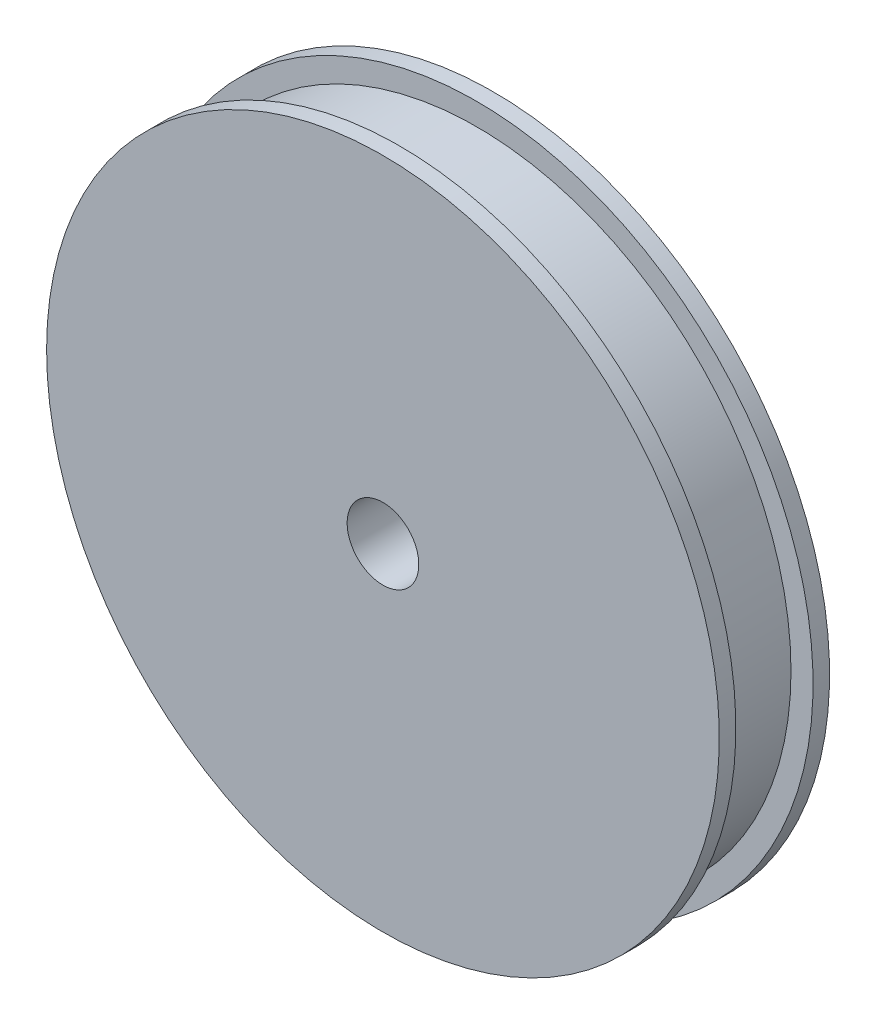
ISO-10303-21;
HEADER;
FILE_DESCRIPTION(('STEP AP214'),'2;1');
FILE_NAME('part.step','',(''),(''),'','','');
FILE_SCHEMA(('AUTOMOTIVE_DESIGN { 1 0 10303 214 1 1 1 1 }'));
ENDSEC;
DATA;
#1=APPLICATION_CONTEXT('core data for automotive mechanical design processes');
#2=APPLICATION_PROTOCOL_DEFINITION('international standard','automotive_design',2000,#1);
#3=PRODUCT_CONTEXT('',#1,'mechanical');
#4=PRODUCT('Part','Part','',(#3));
#5=PRODUCT_RELATED_PRODUCT_CATEGORY('part','',(#4));
#6=PRODUCT_DEFINITION_FORMATION('','',#4);
#7=PRODUCT_DEFINITION_CONTEXT('part definition',#1,'design');
#8=PRODUCT_DEFINITION('design','',#6,#7);
#9=PRODUCT_DEFINITION_SHAPE('','',#8);
#10=(LENGTH_UNIT() NAMED_UNIT(*) SI_UNIT(.MILLI.,.METRE.));
#11=(NAMED_UNIT(*) PLANE_ANGLE_UNIT() SI_UNIT($,.RADIAN.));
#12=(NAMED_UNIT(*) SI_UNIT($,.STERADIAN.) SOLID_ANGLE_UNIT());
#13=UNCERTAINTY_MEASURE_WITH_UNIT(LENGTH_MEASURE(1.E-05),#10,'distance_accuracy_value','');
#14=(GEOMETRIC_REPRESENTATION_CONTEXT(3) GLOBAL_UNCERTAINTY_ASSIGNED_CONTEXT((#13)) GLOBAL_UNIT_ASSIGNED_CONTEXT((#10,
#11,#12)) REPRESENTATION_CONTEXT('',''));
#15=CARTESIAN_POINT('',(0.,0.,0.));
#16=DIRECTION('',(0.,0.,1.));
#17=DIRECTION('',(1.,0.,0.));
#18=AXIS2_PLACEMENT_3D('',#15,#16,#17);
#19=CARTESIAN_POINT('',(0.,0.,0.));
#20=DIRECTION('',(0.,0.,1.));
#21=DIRECTION('',(1.,0.,0.));
#22=AXIS2_PLACEMENT_3D('',#19,#20,#21);
#23=PLANE('',#22);
#24=CARTESIAN_POINT('',(0.,0.,0.));
#25=DIRECTION('',(0.,0.,-1.));
#26=DIRECTION('',(-1.,0.,0.));
#27=AXIS2_PLACEMENT_3D('',#24,#25,#26);
#28=CIRCLE('',#27,3.25);
#29=CARTESIAN_POINT('',(-3.25,0.,0.));
#30=VERTEX_POINT('',#29);
#31=EDGE_CURVE('E64',#30,#30,#28,.T.);
#32=ORIENTED_EDGE('',*,*,#31,.T.);
#33=EDGE_LOOP('',(#32));
#34=FACE_BOUND('',#33,.T.);
#35=CARTESIAN_POINT('',(0.,0.,0.));
#36=DIRECTION('',(0.,0.,-1.));
#37=DIRECTION('',(-1.,0.,0.));
#38=AXIS2_PLACEMENT_3D('',#35,#36,#37);
#39=CIRCLE('',#38,30.5);
#40=CARTESIAN_POINT('',(-30.5,0.,0.));
#41=VERTEX_POINT('',#40);
#42=EDGE_CURVE('E10',#41,#41,#39,.T.);
#43=ORIENTED_EDGE('',*,*,#42,.F.);
#44=EDGE_LOOP('',(#43));
#45=FACE_BOUND('',#44,.T.);
#46=ADVANCED_FACE('F35',(#34,#45),#23,.T.);
#47=CARTESIAN_POINT('',(0.,0.,-10.));
#48=DIRECTION('',(0.,0.,-1.));
#49=DIRECTION('',(-1.,0.,0.));
#50=AXIS2_PLACEMENT_3D('',#47,#48,#49);
#51=CYLINDRICAL_SURFACE('',#50,30.5);
#52=ORIENTED_EDGE('',*,*,#42,.T.);
#53=EDGE_LOOP('',(#52));
#54=FACE_BOUND('',#53,.T.);
#55=CARTESIAN_POINT('',(0.,0.,-1.5));
#56=DIRECTION('',(0.,0.,-1.));
#57=DIRECTION('',(-1.,0.,0.));
#58=AXIS2_PLACEMENT_3D('',#55,#56,#57);
#59=CIRCLE('',#58,30.5);
#60=CARTESIAN_POINT('',(-30.5,0.,-1.5));
#61=VERTEX_POINT('',#60);
#62=EDGE_CURVE('E41',#61,#61,#59,.T.);
#63=ORIENTED_EDGE('',*,*,#62,.F.);
#64=EDGE_LOOP('',(#63));
#65=FACE_BOUND('',#64,.T.);
#66=ADVANCED_FACE('F111',(#54,#65),#51,.T.);
#67=CARTESIAN_POINT('',(0.,30.5,-1.5));
#68=DIRECTION('',(0.,0.,-1.));
#69=DIRECTION('',(-1.,0.,0.));
#70=AXIS2_PLACEMENT_3D('',#67,#68,#69);
#71=PLANE('',#70);
#72=ORIENTED_EDGE('',*,*,#62,.T.);
#73=EDGE_LOOP('',(#72));
#74=FACE_BOUND('',#73,.T.);
#75=CARTESIAN_POINT('',(0.,0.,-1.5));
#76=DIRECTION('',(0.,0.,-1.));
#77=DIRECTION('',(-1.,0.,0.));
#78=AXIS2_PLACEMENT_3D('',#75,#76,#77);
#79=CIRCLE('',#78,28.5);
#80=CARTESIAN_POINT('',(-28.5,0.,-1.5));
#81=VERTEX_POINT('',#80);
#82=EDGE_CURVE('E45',#81,#81,#79,.T.);
#83=ORIENTED_EDGE('',*,*,#82,.F.);
#84=EDGE_LOOP('',(#83));
#85=FACE_BOUND('',#84,.T.);
#86=ADVANCED_FACE('F115',(#74,#85),#71,.T.);
#87=CARTESIAN_POINT('',(0.,0.,-10.));
#88=DIRECTION('',(0.,0.,-1.));
#89=DIRECTION('',(-1.,0.,0.));
#90=AXIS2_PLACEMENT_3D('',#87,#88,#89);
#91=CYLINDRICAL_SURFACE('',#90,28.5);
#92=ORIENTED_EDGE('',*,*,#82,.T.);
#93=EDGE_LOOP('',(#92));
#94=FACE_BOUND('',#93,.T.);
#95=CARTESIAN_POINT('',(0.,0.,-8.5));
#96=DIRECTION('',(0.,0.,-1.));
#97=DIRECTION('',(-1.,0.,0.));
#98=AXIS2_PLACEMENT_3D('',#95,#96,#97);
#99=CIRCLE('',#98,28.5);
#100=CARTESIAN_POINT('',(-28.5,0.,-8.5));
#101=VERTEX_POINT('',#100);
#102=EDGE_CURVE('E49',#101,#101,#99,.T.);
#103=ORIENTED_EDGE('',*,*,#102,.F.);
#104=EDGE_LOOP('',(#103));
#105=FACE_BOUND('',#104,.T.);
#106=ADVANCED_FACE('F107',(#94,#105),#91,.T.);
#107=CARTESIAN_POINT('',(0.,28.5,-8.5));
#108=DIRECTION('',(0.,0.,1.));
#109=DIRECTION('',(1.,0.,0.));
#110=AXIS2_PLACEMENT_3D('',#107,#108,#109);
#111=PLANE('',#110);
#112=ORIENTED_EDGE('',*,*,#102,.T.);
#113=EDGE_LOOP('',(#112));
#114=FACE_BOUND('',#113,.T.);
#115=CARTESIAN_POINT('',(0.,0.,-8.5));
#116=DIRECTION('',(0.,0.,-1.));
#117=DIRECTION('',(-1.,0.,0.));
#118=AXIS2_PLACEMENT_3D('',#115,#116,#117);
#119=CIRCLE('',#118,30.5);
#120=CARTESIAN_POINT('',(-30.5,0.,-8.5));
#121=VERTEX_POINT('',#120);
#122=EDGE_CURVE('E54',#121,#121,#119,.T.);
#123=ORIENTED_EDGE('',*,*,#122,.F.);
#124=EDGE_LOOP('',(#123));
#125=FACE_BOUND('',#124,.T.);
#126=ADVANCED_FACE('F101',(#114,#125),#111,.T.);
#127=CARTESIAN_POINT('',(0.,0.,-10.));
#128=DIRECTION('',(0.,0.,-1.));
#129=DIRECTION('',(-1.,0.,0.));
#130=AXIS2_PLACEMENT_3D('',#127,#128,#129);
#131=CYLINDRICAL_SURFACE('',#130,30.5);
#132=ORIENTED_EDGE('',*,*,#122,.T.);
#133=EDGE_LOOP('',(#132));
#134=FACE_BOUND('',#133,.T.);
#135=CARTESIAN_POINT('',(0.,0.,-10.));
#136=DIRECTION('',(0.,0.,-1.));
#137=DIRECTION('',(-1.,0.,0.));
#138=AXIS2_PLACEMENT_3D('',#135,#136,#137);
#139=CIRCLE('',#138,30.5);
#140=CARTESIAN_POINT('',(-30.5,0.,-10.));
#141=VERTEX_POINT('',#140);
#142=EDGE_CURVE('E57',#141,#141,#139,.T.);
#143=ORIENTED_EDGE('',*,*,#142,.F.);
#144=EDGE_LOOP('',(#143));
#145=FACE_BOUND('',#144,.T.);
#146=ADVANCED_FACE('F96',(#134,#145),#131,.T.);
#147=CARTESIAN_POINT('',(0.,30.5,-10.));
#148=DIRECTION('',(0.,0.,-1.));
#149=DIRECTION('',(-1.,0.,0.));
#150=AXIS2_PLACEMENT_3D('',#147,#148,#149);
#151=PLANE('',#150);
#152=CARTESIAN_POINT('',(0.,0.,-10.));
#153=DIRECTION('',(0.,0.,-1.));
#154=DIRECTION('',(-1.,0.,0.));
#155=AXIS2_PLACEMENT_3D('',#152,#153,#154);
#156=CIRCLE('',#155,15.);
#157=CARTESIAN_POINT('',(-15.,0.,-10.));
#158=VERTEX_POINT('',#157);
#159=EDGE_CURVE('E61',#158,#158,#156,.T.);
#160=ORIENTED_EDGE('',*,*,#159,.F.);
#161=EDGE_LOOP('',(#160));
#162=FACE_BOUND('',#161,.T.);
#163=ORIENTED_EDGE('',*,*,#142,.T.);
#164=EDGE_LOOP('',(#163));
#165=FACE_BOUND('',#164,.T.);
#166=ADVANCED_FACE('F90',(#162,#165),#151,.T.);
#167=CARTESIAN_POINT('',(0.,0.,-17.));
#168=DIRECTION('',(0.,0.,1.));
#169=DIRECTION('',(1.,0.,0.));
#170=AXIS2_PLACEMENT_3D('',#167,#168,#169);
#171=CYLINDRICAL_SURFACE('',#170,15.);
#172=CARTESIAN_POINT('',(0.,0.,-17.));
#173=DIRECTION('',(0.,0.,-1.));
#174=DIRECTION('',(-1.,0.,0.));
#175=AXIS2_PLACEMENT_3D('',#172,#173,#174);
#176=CIRCLE('',#175,15.);
#177=CARTESIAN_POINT('',(-15.,0.,-17.));
#178=VERTEX_POINT('',#177);
#179=EDGE_CURVE('E60',#178,#178,#176,.T.);
#180=ORIENTED_EDGE('',*,*,#179,.F.);
#181=EDGE_LOOP('',(#180));
#182=FACE_BOUND('',#181,.T.);
#183=ORIENTED_EDGE('',*,*,#159,.T.);
#184=EDGE_LOOP('',(#183));
#185=FACE_BOUND('',#184,.T.);
#186=ADVANCED_FACE('F84',(#182,#185),#171,.T.);
#187=CARTESIAN_POINT('',(0.,0.,-17.));
#188=DIRECTION('',(0.,0.,-1.));
#189=DIRECTION('',(-1.,0.,0.));
#190=AXIS2_PLACEMENT_3D('',#187,#188,#189);
#191=PLANE('',#190);
#192=CARTESIAN_POINT('',(0.,0.,-17.));
#193=DIRECTION('',(0.,0.,-1.));
#194=DIRECTION('',(-1.,0.,0.));
#195=AXIS2_PLACEMENT_3D('',#192,#193,#194);
#196=CIRCLE('',#195,3.25);
#197=CARTESIAN_POINT('',(-3.25,0.,-17.));
#198=VERTEX_POINT('',#197);
#199=EDGE_CURVE('E67',#198,#198,#196,.T.);
#200=ORIENTED_EDGE('',*,*,#199,.F.);
#201=EDGE_LOOP('',(#200));
#202=FACE_BOUND('',#201,.T.);
#203=ORIENTED_EDGE('',*,*,#179,.T.);
#204=EDGE_LOOP('',(#203));
#205=FACE_BOUND('',#204,.T.);
#206=ADVANCED_FACE('F78',(#202,#205),#191,.T.);
#207=CARTESIAN_POINT('',(0.,0.,0.));
#208=DIRECTION('',(0.,0.,-1.));
#209=DIRECTION('',(-1.,0.,0.));
#210=AXIS2_PLACEMENT_3D('',#207,#208,#209);
#211=CYLINDRICAL_SURFACE('',#210,3.25);
#212=ORIENTED_EDGE('',*,*,#31,.F.);
#213=EDGE_LOOP('',(#212));
#214=FACE_BOUND('',#213,.T.);
#215=ORIENTED_EDGE('',*,*,#199,.T.);
#216=EDGE_LOOP('',(#215));
#217=FACE_BOUND('',#216,.T.);
#218=ADVANCED_FACE('F75',(#214,#217),#211,.F.);
#219=CLOSED_SHELL('',(#46,#66,#86,#106,#126,#146,#166,#186,#206,#218));
#220=MANIFOLD_SOLID_BREP('B2',#219);
#221=ADVANCED_BREP_SHAPE_REPRESENTATION('',(#18,#220),#14);
#222=SHAPE_DEFINITION_REPRESENTATION(#9,#221);
ENDSEC;
END-ISO-10303-21;
